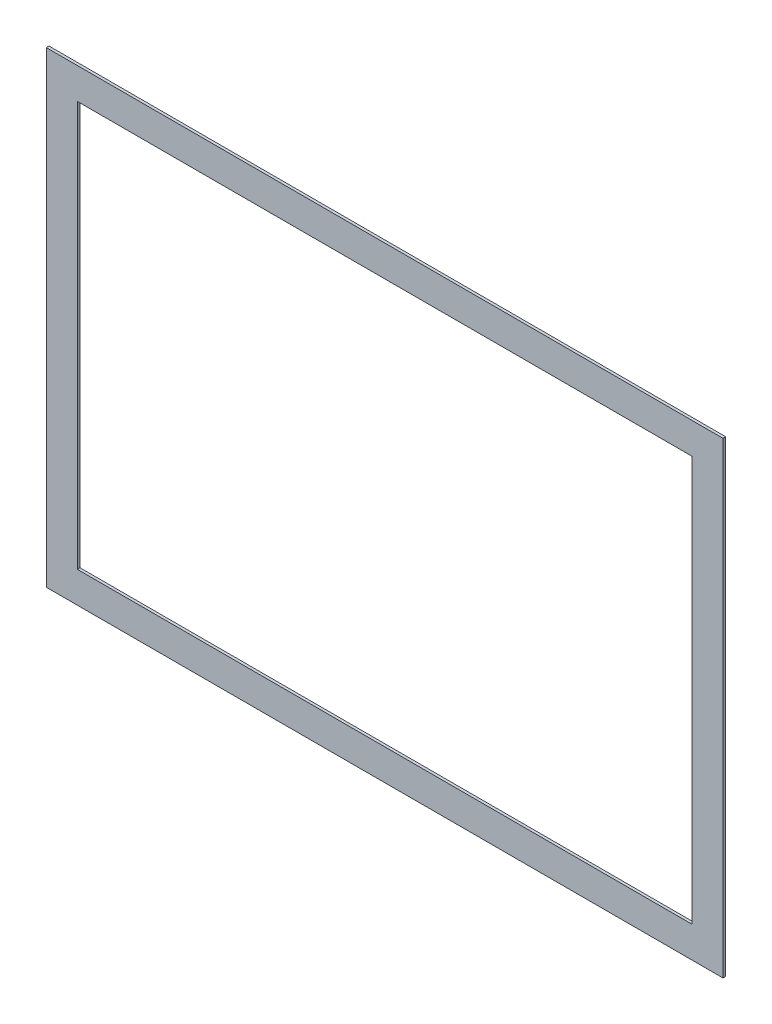
ISO-10303-21;
HEADER;
FILE_DESCRIPTION(('STEP AP214'),'2;1');
FILE_NAME('part.step','',(''),(''),'','','');
FILE_SCHEMA(('AUTOMOTIVE_DESIGN { 1 0 10303 214 1 1 1 1 }'));
ENDSEC;
DATA;
#1=APPLICATION_CONTEXT('core data for automotive mechanical design processes');
#2=APPLICATION_PROTOCOL_DEFINITION('international standard','automotive_design',2000,#1);
#3=PRODUCT_CONTEXT('',#1,'mechanical');
#4=PRODUCT('Part','Part','',(#3));
#5=PRODUCT_RELATED_PRODUCT_CATEGORY('part','',(#4));
#6=PRODUCT_DEFINITION_FORMATION('','',#4);
#7=PRODUCT_DEFINITION_CONTEXT('part definition',#1,'design');
#8=PRODUCT_DEFINITION('design','',#6,#7);
#9=PRODUCT_DEFINITION_SHAPE('','',#8);
#10=(LENGTH_UNIT() NAMED_UNIT(*) SI_UNIT(.MILLI.,.METRE.));
#11=(NAMED_UNIT(*) PLANE_ANGLE_UNIT() SI_UNIT($,.RADIAN.));
#12=(NAMED_UNIT(*) SI_UNIT($,.STERADIAN.) SOLID_ANGLE_UNIT());
#13=UNCERTAINTY_MEASURE_WITH_UNIT(LENGTH_MEASURE(1.E-05),#10,'distance_accuracy_value','');
#14=(GEOMETRIC_REPRESENTATION_CONTEXT(3) GLOBAL_UNCERTAINTY_ASSIGNED_CONTEXT((#13)) GLOBAL_UNIT_ASSIGNED_CONTEXT((#10,
#11,#12)) REPRESENTATION_CONTEXT('',''));
#15=CARTESIAN_POINT('',(0.,0.,0.));
#16=DIRECTION('',(0.,0.,1.));
#17=DIRECTION('',(1.,0.,0.));
#18=AXIS2_PLACEMENT_3D('',#15,#16,#17);
#19=CARTESIAN_POINT('',(-23.,323.,-2.));
#20=DIRECTION('',(-1.,0.,0.));
#21=DIRECTION('',(0.,-1.,0.));
#22=AXIS2_PLACEMENT_3D('',#19,#20,#21);
#23=PLANE('',#22);
#24=DIRECTION('',(0.,-1.,0.));
#25=VECTOR('',#24,1.);
#26=CARTESIAN_POINT('',(-23.,323.,0.));
#27=LINE('',#26,#25);
#28=CARTESIAN_POINT('',(-23.,323.,0.));
#29=VERTEX_POINT('',#28);
#30=CARTESIAN_POINT('',(-22.9999999999999,-23.,0.));
#31=VERTEX_POINT('',#30);
#32=EDGE_CURVE('E136',#29,#31,#27,.T.);
#33=ORIENTED_EDGE('',*,*,#32,.F.);
#34=DIRECTION('',(0.,0.,1.));
#35=VECTOR('',#34,1.);
#36=CARTESIAN_POINT('',(-23.,323.,-2.));
#37=LINE('',#36,#35);
#38=CARTESIAN_POINT('',(-23.,323.,-2.));
#39=VERTEX_POINT('',#38);
#40=EDGE_CURVE('E11',#39,#29,#37,.T.);
#41=ORIENTED_EDGE('',*,*,#40,.F.);
#42=DIRECTION('',(0.,-1.,0.));
#43=VECTOR('',#42,1.);
#44=CARTESIAN_POINT('',(-23.,323.,-2.));
#45=LINE('',#44,#43);
#46=CARTESIAN_POINT('',(-22.9999999999999,-23.,-2.));
#47=VERTEX_POINT('',#46);
#48=EDGE_CURVE('E140',#39,#47,#45,.T.);
#49=ORIENTED_EDGE('',*,*,#48,.T.);
#50=DIRECTION('',(0.,0.,1.));
#51=VECTOR('',#50,1.);
#52=CARTESIAN_POINT('',(-22.9999999999999,-23.,-2.));
#53=LINE('',#52,#51);
#54=EDGE_CURVE('E41',#47,#31,#53,.T.);
#55=ORIENTED_EDGE('',*,*,#54,.T.);
#56=EDGE_LOOP('',(#33,#41,#49,#55));
#57=FACE_BOUND('',#56,.T.);
#58=ADVANCED_FACE('F38',(#57),#23,.T.);
#59=CARTESIAN_POINT('',(-23.,323.,-2.));
#60=DIRECTION('',(0.,1.,0.));
#61=DIRECTION('',(0.,0.,1.));
#62=AXIS2_PLACEMENT_3D('',#59,#60,#61);
#63=PLANE('',#62);
#64=DIRECTION('',(-1.,0.,0.));
#65=VECTOR('',#64,1.);
#66=CARTESIAN_POINT('',(-23.,323.,0.));
#67=LINE('',#66,#65);
#68=CARTESIAN_POINT('',(478.,323.,0.));
#69=VERTEX_POINT('',#68);
#70=EDGE_CURVE('E144',#69,#29,#67,.T.);
#71=ORIENTED_EDGE('',*,*,#70,.F.);
#72=DIRECTION('',(0.,0.,1.));
#73=VECTOR('',#72,1.);
#74=CARTESIAN_POINT('',(478.,323.,-2.));
#75=LINE('',#74,#73);
#76=CARTESIAN_POINT('',(478.,323.,-2.));
#77=VERTEX_POINT('',#76);
#78=EDGE_CURVE('E46',#77,#69,#75,.T.);
#79=ORIENTED_EDGE('',*,*,#78,.F.);
#80=DIRECTION('',(-1.,0.,0.));
#81=VECTOR('',#80,1.);
#82=CARTESIAN_POINT('',(-23.,323.,-2.));
#83=LINE('',#82,#81);
#84=EDGE_CURVE('E150',#77,#39,#83,.T.);
#85=ORIENTED_EDGE('',*,*,#84,.T.);
#86=ORIENTED_EDGE('',*,*,#40,.T.);
#87=EDGE_LOOP('',(#71,#79,#85,#86));
#88=FACE_BOUND('',#87,.T.);
#89=ADVANCED_FACE('F176',(#88),#63,.T.);
#90=CARTESIAN_POINT('',(478.,323.,-2.));
#91=DIRECTION('',(1.,0.,0.));
#92=DIRECTION('',(0.,0.,-1.));
#93=AXIS2_PLACEMENT_3D('',#90,#91,#92);
#94=PLANE('',#93);
#95=DIRECTION('',(0.,1.,0.));
#96=VECTOR('',#95,1.);
#97=CARTESIAN_POINT('',(478.,323.,0.));
#98=LINE('',#97,#96);
#99=CARTESIAN_POINT('',(478.,-23.,0.));
#100=VERTEX_POINT('',#99);
#101=EDGE_CURVE('E158',#100,#69,#98,.T.);
#102=ORIENTED_EDGE('',*,*,#101,.F.);
#103=DIRECTION('',(0.,0.,1.));
#104=VECTOR('',#103,1.);
#105=CARTESIAN_POINT('',(478.,-23.,-2.));
#106=LINE('',#105,#104);
#107=CARTESIAN_POINT('',(478.,-23.,-2.));
#108=VERTEX_POINT('',#107);
#109=EDGE_CURVE('E163',#108,#100,#106,.T.);
#110=ORIENTED_EDGE('',*,*,#109,.F.);
#111=DIRECTION('',(0.,1.,0.));
#112=VECTOR('',#111,1.);
#113=CARTESIAN_POINT('',(478.,323.,-2.));
#114=LINE('',#113,#112);
#115=EDGE_CURVE('E147',#108,#77,#114,.T.);
#116=ORIENTED_EDGE('',*,*,#115,.T.);
#117=ORIENTED_EDGE('',*,*,#78,.T.);
#118=EDGE_LOOP('',(#102,#110,#116,#117));
#119=FACE_BOUND('',#118,.T.);
#120=ADVANCED_FACE('F180',(#119),#94,.T.);
#121=CARTESIAN_POINT('',(-22.9999999999999,-23.,-2.));
#122=DIRECTION('',(0.,-1.,0.));
#123=DIRECTION('',(1.,0.,0.));
#124=AXIS2_PLACEMENT_3D('',#121,#122,#123);
#125=PLANE('',#124);
#126=DIRECTION('',(1.,0.,0.));
#127=VECTOR('',#126,1.);
#128=CARTESIAN_POINT('',(-22.9999999999999,-23.,0.));
#129=LINE('',#128,#127);
#130=EDGE_CURVE('E155',#31,#100,#129,.T.);
#131=ORIENTED_EDGE('',*,*,#130,.F.);
#132=ORIENTED_EDGE('',*,*,#54,.F.);
#133=DIRECTION('',(1.,0.,0.));
#134=VECTOR('',#133,1.);
#135=CARTESIAN_POINT('',(-22.9999999999999,-23.,-2.));
#136=LINE('',#135,#134);
#137=EDGE_CURVE('E143',#47,#108,#136,.T.);
#138=ORIENTED_EDGE('',*,*,#137,.T.);
#139=ORIENTED_EDGE('',*,*,#109,.T.);
#140=EDGE_LOOP('',(#131,#132,#138,#139));
#141=FACE_BOUND('',#140,.T.);
#142=ADVANCED_FACE('F171',(#141),#125,.T.);
#143=CARTESIAN_POINT('',(0.,0.,-2.));
#144=DIRECTION('',(0.,0.,1.));
#145=DIRECTION('',(1.,0.,0.));
#146=AXIS2_PLACEMENT_3D('',#143,#144,#145);
#147=PLANE('',#146);
#148=DIRECTION('',(-1.,0.,0.));
#149=VECTOR('',#148,1.);
#150=CARTESIAN_POINT('',(0.,300.,-2.));
#151=LINE('',#150,#149);
#152=CARTESIAN_POINT('',(455.,300.,-2.));
#153=VERTEX_POINT('',#152);
#154=CARTESIAN_POINT('',(0.,300.,-2.));
#155=VERTEX_POINT('',#154);
#156=EDGE_CURVE('E111',#153,#155,#151,.T.);
#157=ORIENTED_EDGE('',*,*,#156,.T.);
#158=DIRECTION('',(0.,-1.,0.));
#159=VECTOR('',#158,1.);
#160=CARTESIAN_POINT('',(0.,300.,-2.));
#161=LINE('',#160,#159);
#162=CARTESIAN_POINT('',(0.,0.,-2.));
#163=VERTEX_POINT('',#162);
#164=EDGE_CURVE('E105',#155,#163,#161,.T.);
#165=ORIENTED_EDGE('',*,*,#164,.T.);
#166=DIRECTION('',(1.,0.,0.));
#167=VECTOR('',#166,1.);
#168=CARTESIAN_POINT('',(0.,0.,-2.));
#169=LINE('',#168,#167);
#170=CARTESIAN_POINT('',(455.,0.,-2.));
#171=VERTEX_POINT('',#170);
#172=EDGE_CURVE('E114',#163,#171,#169,.T.);
#173=ORIENTED_EDGE('',*,*,#172,.T.);
#174=DIRECTION('',(0.,1.,0.));
#175=VECTOR('',#174,1.);
#176=CARTESIAN_POINT('',(455.,300.,-2.));
#177=LINE('',#176,#175);
#178=EDGE_CURVE('E54',#171,#153,#177,.T.);
#179=ORIENTED_EDGE('',*,*,#178,.T.);
#180=EDGE_LOOP('',(#157,#165,#173,#179));
#181=FACE_BOUND('',#180,.T.);
#182=ORIENTED_EDGE('',*,*,#48,.F.);
#183=ORIENTED_EDGE('',*,*,#84,.F.);
#184=ORIENTED_EDGE('',*,*,#115,.F.);
#185=ORIENTED_EDGE('',*,*,#137,.F.);
#186=EDGE_LOOP('',(#182,#183,#184,#185));
#187=FACE_BOUND('',#186,.T.);
#188=ADVANCED_FACE('F118',(#181,#187),#147,.F.);
#189=CARTESIAN_POINT('',(0.,0.,0.));
#190=DIRECTION('',(0.,0.,1.));
#191=DIRECTION('',(1.,0.,0.));
#192=AXIS2_PLACEMENT_3D('',#189,#190,#191);
#193=PLANE('',#192);
#194=DIRECTION('',(0.,-1.,0.));
#195=VECTOR('',#194,1.);
#196=CARTESIAN_POINT('',(0.,300.,0.));
#197=LINE('',#196,#195);
#198=CARTESIAN_POINT('',(0.,300.,0.));
#199=VERTEX_POINT('',#198);
#200=CARTESIAN_POINT('',(0.,0.,0.));
#201=VERTEX_POINT('',#200);
#202=EDGE_CURVE('E62',#199,#201,#197,.T.);
#203=ORIENTED_EDGE('',*,*,#202,.F.);
#204=DIRECTION('',(-1.,0.,0.));
#205=VECTOR('',#204,1.);
#206=CARTESIAN_POINT('',(0.,300.,0.));
#207=LINE('',#206,#205);
#208=CARTESIAN_POINT('',(455.,300.,0.));
#209=VERTEX_POINT('',#208);
#210=EDGE_CURVE('E121',#209,#199,#207,.T.);
#211=ORIENTED_EDGE('',*,*,#210,.F.);
#212=DIRECTION('',(0.,1.,0.));
#213=VECTOR('',#212,1.);
#214=CARTESIAN_POINT('',(455.,300.,0.));
#215=LINE('',#214,#213);
#216=CARTESIAN_POINT('',(455.,0.,0.));
#217=VERTEX_POINT('',#216);
#218=EDGE_CURVE('E124',#217,#209,#215,.T.);
#219=ORIENTED_EDGE('',*,*,#218,.F.);
#220=DIRECTION('',(1.,0.,0.));
#221=VECTOR('',#220,1.);
#222=CARTESIAN_POINT('',(0.,0.,0.));
#223=LINE('',#222,#221);
#224=EDGE_CURVE('E130',#201,#217,#223,.T.);
#225=ORIENTED_EDGE('',*,*,#224,.F.);
#226=EDGE_LOOP('',(#203,#211,#219,#225));
#227=FACE_BOUND('',#226,.T.);
#228=ORIENTED_EDGE('',*,*,#32,.T.);
#229=ORIENTED_EDGE('',*,*,#130,.T.);
#230=ORIENTED_EDGE('',*,*,#101,.T.);
#231=ORIENTED_EDGE('',*,*,#70,.T.);
#232=EDGE_LOOP('',(#228,#229,#230,#231));
#233=FACE_BOUND('',#232,.T.);
#234=ADVANCED_FACE('F173',(#227,#233),#193,.T.);
#235=CARTESIAN_POINT('',(0.,300.,-2.));
#236=DIRECTION('',(-1.,0.,0.));
#237=DIRECTION('',(0.,-1.,0.));
#238=AXIS2_PLACEMENT_3D('',#235,#236,#237);
#239=PLANE('',#238);
#240=ORIENTED_EDGE('',*,*,#202,.T.);
#241=DIRECTION('',(0.,0.,1.));
#242=VECTOR('',#241,1.);
#243=CARTESIAN_POINT('',(0.,0.,-2.));
#244=LINE('',#243,#242);
#245=EDGE_CURVE('E101',#163,#201,#244,.T.);
#246=ORIENTED_EDGE('',*,*,#245,.F.);
#247=ORIENTED_EDGE('',*,*,#164,.F.);
#248=DIRECTION('',(0.,0.,1.));
#249=VECTOR('',#248,1.);
#250=CARTESIAN_POINT('',(0.,300.,-2.));
#251=LINE('',#250,#249);
#252=EDGE_CURVE('E134',#155,#199,#251,.T.);
#253=ORIENTED_EDGE('',*,*,#252,.T.);
#254=EDGE_LOOP('',(#240,#246,#247,#253));
#255=FACE_BOUND('',#254,.T.);
#256=ADVANCED_FACE('F103',(#255),#239,.F.);
#257=CARTESIAN_POINT('',(0.,300.,-2.));
#258=DIRECTION('',(0.,1.,0.));
#259=DIRECTION('',(0.,0.,1.));
#260=AXIS2_PLACEMENT_3D('',#257,#258,#259);
#261=PLANE('',#260);
#262=ORIENTED_EDGE('',*,*,#210,.T.);
#263=ORIENTED_EDGE('',*,*,#252,.F.);
#264=ORIENTED_EDGE('',*,*,#156,.F.);
#265=DIRECTION('',(0.,0.,1.));
#266=VECTOR('',#265,1.);
#267=CARTESIAN_POINT('',(455.,300.,-2.));
#268=LINE('',#267,#266);
#269=EDGE_CURVE('E137',#153,#209,#268,.T.);
#270=ORIENTED_EDGE('',*,*,#269,.T.);
#271=EDGE_LOOP('',(#262,#263,#264,#270));
#272=FACE_BOUND('',#271,.T.);
#273=ADVANCED_FACE('F236',(#272),#261,.F.);
#274=CARTESIAN_POINT('',(455.,300.,-2.));
#275=DIRECTION('',(1.,0.,0.));
#276=DIRECTION('',(0.,1.,0.));
#277=AXIS2_PLACEMENT_3D('',#274,#275,#276);
#278=PLANE('',#277);
#279=ORIENTED_EDGE('',*,*,#218,.T.);
#280=ORIENTED_EDGE('',*,*,#269,.F.);
#281=ORIENTED_EDGE('',*,*,#178,.F.);
#282=DIRECTION('',(0.,0.,1.));
#283=VECTOR('',#282,1.);
#284=CARTESIAN_POINT('',(455.,0.,-2.));
#285=LINE('',#284,#283);
#286=EDGE_CURVE('E110',#171,#217,#285,.T.);
#287=ORIENTED_EDGE('',*,*,#286,.T.);
#288=EDGE_LOOP('',(#279,#280,#281,#287));
#289=FACE_BOUND('',#288,.T.);
#290=ADVANCED_FACE('F246',(#289),#278,.F.);
#291=CARTESIAN_POINT('',(0.,0.,-2.));
#292=DIRECTION('',(0.,-1.,0.));
#293=DIRECTION('',(0.,0.,-1.));
#294=AXIS2_PLACEMENT_3D('',#291,#292,#293);
#295=PLANE('',#294);
#296=ORIENTED_EDGE('',*,*,#224,.T.);
#297=ORIENTED_EDGE('',*,*,#286,.F.);
#298=ORIENTED_EDGE('',*,*,#172,.F.);
#299=ORIENTED_EDGE('',*,*,#245,.T.);
#300=EDGE_LOOP('',(#296,#297,#298,#299));
#301=FACE_BOUND('',#300,.T.);
#302=ADVANCED_FACE('F115',(#301),#295,.F.);
#303=CLOSED_SHELL('',(#58,#89,#120,#142,#188,#234,#256,#273,#290,#302));
#304=MANIFOLD_SOLID_BREP('B2',#303);
#305=ADVANCED_BREP_SHAPE_REPRESENTATION('',(#18,#304),#14);
#306=SHAPE_DEFINITION_REPRESENTATION(#9,#305);
ENDSEC;
END-ISO-10303-21;
